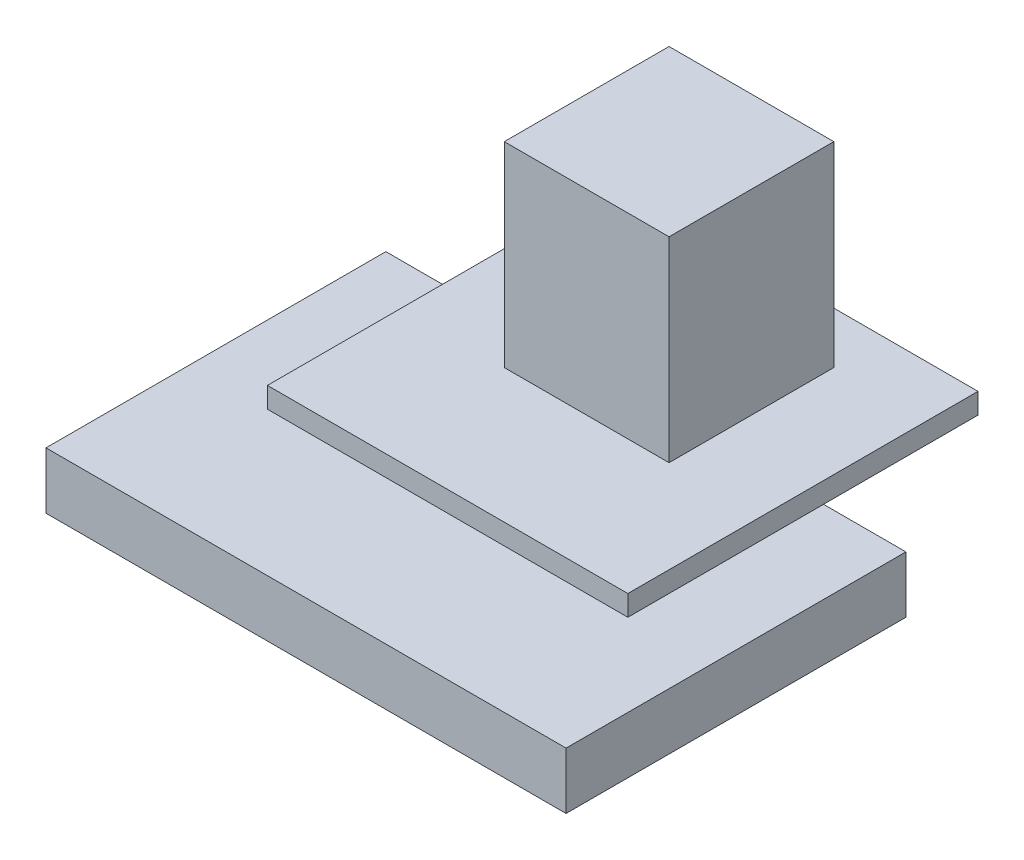
ISO-10303-21;
HEADER;
FILE_DESCRIPTION(('STEP AP214'),'2;1');
FILE_NAME('part.step','',(''),(''),'','','');
FILE_SCHEMA(('AUTOMOTIVE_DESIGN { 1 0 10303 214 1 1 1 1 }'));
ENDSEC;
DATA;
#1=APPLICATION_CONTEXT('core data for automotive mechanical design processes');
#2=APPLICATION_PROTOCOL_DEFINITION('international standard','automotive_design',2000,#1);
#3=PRODUCT_CONTEXT('',#1,'mechanical');
#4=PRODUCT('Part','Part','',(#3));
#5=PRODUCT_RELATED_PRODUCT_CATEGORY('part','',(#4));
#6=PRODUCT_DEFINITION_FORMATION('','',#4);
#7=PRODUCT_DEFINITION_CONTEXT('part definition',#1,'design');
#8=PRODUCT_DEFINITION('design','',#6,#7);
#9=PRODUCT_DEFINITION_SHAPE('','',#8);
#10=(LENGTH_UNIT() NAMED_UNIT(*) SI_UNIT(.MILLI.,.METRE.));
#11=(NAMED_UNIT(*) PLANE_ANGLE_UNIT() SI_UNIT($,.RADIAN.));
#12=(NAMED_UNIT(*) SI_UNIT($,.STERADIAN.) SOLID_ANGLE_UNIT());
#13=UNCERTAINTY_MEASURE_WITH_UNIT(LENGTH_MEASURE(1.E-05),#10,'distance_accuracy_value','');
#14=(GEOMETRIC_REPRESENTATION_CONTEXT(3) GLOBAL_UNCERTAINTY_ASSIGNED_CONTEXT((#13)) GLOBAL_UNIT_ASSIGNED_CONTEXT((#10,
#11,#12)) REPRESENTATION_CONTEXT('',''));
#15=CARTESIAN_POINT('',(0.,0.,0.));
#16=DIRECTION('',(0.,0.,1.));
#17=DIRECTION('',(1.,0.,0.));
#18=AXIS2_PLACEMENT_3D('',#15,#16,#17);
#19=CARTESIAN_POINT('',(0.,7.5,0.));
#20=DIRECTION('',(0.,-1.,0.));
#21=DIRECTION('',(0.,0.,-1.));
#22=AXIS2_PLACEMENT_3D('',#19,#20,#21);
#23=PLANE('',#22);
#24=DIRECTION('',(0.,0.,1.));
#25=VECTOR('',#24,1.);
#26=CARTESIAN_POINT('',(7.49999999999999,7.5,-14.));
#27=LINE('',#26,#25);
#28=CARTESIAN_POINT('',(7.49999999999999,7.5,-48.));
#29=VERTEX_POINT('',#28);
#30=CARTESIAN_POINT('',(7.49999999999999,7.5,-14.));
#31=VERTEX_POINT('',#30);
#32=EDGE_CURVE('E169',#29,#31,#27,.T.);
#33=ORIENTED_EDGE('',*,*,#32,.T.);
#34=DIRECTION('',(1.,0.,0.));
#35=VECTOR('',#34,1.);
#36=CARTESIAN_POINT('',(7.49999999999999,7.5,-14.));
#37=LINE('',#36,#35);
#38=CARTESIAN_POINT('',(42.5,7.5,-14.));
#39=VERTEX_POINT('',#38);
#40=EDGE_CURVE('E173',#31,#39,#37,.T.);
#41=ORIENTED_EDGE('',*,*,#40,.T.);
#42=DIRECTION('',(0.,0.,-1.));
#43=VECTOR('',#42,1.);
#44=CARTESIAN_POINT('',(42.5,7.5,-14.));
#45=LINE('',#44,#43);
#46=CARTESIAN_POINT('',(42.5,7.5,-48.));
#47=VERTEX_POINT('',#46);
#48=EDGE_CURVE('E177',#39,#47,#45,.T.);
#49=ORIENTED_EDGE('',*,*,#48,.T.);
#50=DIRECTION('',(-1.,0.,0.));
#51=VECTOR('',#50,1.);
#52=CARTESIAN_POINT('',(7.49999999999999,7.5,-48.));
#53=LINE('',#52,#51);
#54=EDGE_CURVE('E180',#47,#29,#53,.T.);
#55=ORIENTED_EDGE('',*,*,#54,.T.);
#56=EDGE_LOOP('',(#33,#41,#49,#55));
#57=FACE_BOUND('',#56,.T.);
#58=DIRECTION('',(0.,0.,1.));
#59=VECTOR('',#58,1.);
#60=CARTESIAN_POINT('',(17.5,7.5,-27.));
#61=LINE('',#60,#59);
#62=CARTESIAN_POINT('',(17.5,7.5,-43.));
#63=VERTEX_POINT('',#62);
#64=CARTESIAN_POINT('',(17.5,7.5,-27.));
#65=VERTEX_POINT('',#64);
#66=EDGE_CURVE('E57',#63,#65,#61,.T.);
#67=ORIENTED_EDGE('',*,*,#66,.F.);
#68=DIRECTION('',(-1.,0.,0.));
#69=VECTOR('',#68,1.);
#70=CARTESIAN_POINT('',(17.5,7.5,-43.));
#71=LINE('',#70,#69);
#72=CARTESIAN_POINT('',(33.5,7.5,-43.));
#73=VERTEX_POINT('',#72);
#74=EDGE_CURVE('E61',#73,#63,#71,.T.);
#75=ORIENTED_EDGE('',*,*,#74,.F.);
#76=DIRECTION('',(0.,0.,-1.));
#77=VECTOR('',#76,1.);
#78=CARTESIAN_POINT('',(33.5,7.5,-27.));
#79=LINE('',#78,#77);
#80=CARTESIAN_POINT('',(33.5,7.5,-27.));
#81=VERTEX_POINT('',#80);
#82=EDGE_CURVE('E424',#81,#73,#79,.T.);
#83=ORIENTED_EDGE('',*,*,#82,.F.);
#84=DIRECTION('',(1.,0.,0.));
#85=VECTOR('',#84,1.);
#86=CARTESIAN_POINT('',(17.5,7.5,-27.));
#87=LINE('',#86,#85);
#88=EDGE_CURVE('E434',#65,#81,#87,.T.);
#89=ORIENTED_EDGE('',*,*,#88,.F.);
#90=EDGE_LOOP('',(#67,#75,#83,#89));
#91=FACE_BOUND('',#90,.T.);
#92=ADVANCED_FACE('F39',(#57,#91),#23,.F.);
#93=CARTESIAN_POINT('',(0.,5.5,0.));
#94=DIRECTION('',(0.,-1.,0.));
#95=DIRECTION('',(0.,0.,-1.));
#96=AXIS2_PLACEMENT_3D('',#93,#94,#95);
#97=PLANE('',#96);
#98=DIRECTION('',(0.,0.,1.));
#99=VECTOR('',#98,1.);
#100=CARTESIAN_POINT('',(7.49999999999999,5.5,-14.));
#101=LINE('',#100,#99);
#102=CARTESIAN_POINT('',(7.49999999999999,5.5,-33.));
#103=VERTEX_POINT('',#102);
#104=CARTESIAN_POINT('',(7.49999999999999,5.5,-14.));
#105=VERTEX_POINT('',#104);
#106=EDGE_CURVE('E11',#103,#105,#101,.T.);
#107=ORIENTED_EDGE('',*,*,#106,.F.);
#108=DIRECTION('',(-1.,0.,0.));
#109=VECTOR('',#108,1.);
#110=CARTESIAN_POINT('',(0.,5.5,-33.));
#111=LINE('',#110,#109);
#112=CARTESIAN_POINT('',(0.,5.5,-33.));
#113=VERTEX_POINT('',#112);
#114=EDGE_CURVE('E221',#103,#113,#111,.T.);
#115=ORIENTED_EDGE('',*,*,#114,.T.);
#116=DIRECTION('',(0.,0.,1.));
#117=VECTOR('',#116,1.);
#118=CARTESIAN_POINT('',(0.,5.5,0.));
#119=LINE('',#118,#117);
#120=CARTESIAN_POINT('',(0.,5.5,0.));
#121=VERTEX_POINT('',#120);
#122=EDGE_CURVE('E210',#113,#121,#119,.T.);
#123=ORIENTED_EDGE('',*,*,#122,.T.);
#124=DIRECTION('',(1.,0.,0.));
#125=VECTOR('',#124,1.);
#126=CARTESIAN_POINT('',(0.,5.5,0.));
#127=LINE('',#126,#125);
#128=CARTESIAN_POINT('',(50.5,5.5,0.));
#129=VERTEX_POINT('',#128);
#130=EDGE_CURVE('E214',#121,#129,#127,.T.);
#131=ORIENTED_EDGE('',*,*,#130,.T.);
#132=DIRECTION('',(0.,0.,-1.));
#133=VECTOR('',#132,1.);
#134=CARTESIAN_POINT('',(50.5,5.5,0.));
#135=LINE('',#134,#133);
#136=CARTESIAN_POINT('',(50.5,5.5,-33.));
#137=VERTEX_POINT('',#136);
#138=EDGE_CURVE('E218',#129,#137,#135,.T.);
#139=ORIENTED_EDGE('',*,*,#138,.T.);
#140=CARTESIAN_POINT('',(42.5,5.5,-33.));
#141=VERTEX_POINT('',#140);
#142=EDGE_CURVE('E222',#137,#141,#111,.T.);
#143=ORIENTED_EDGE('',*,*,#142,.T.);
#144=DIRECTION('',(0.,0.,-1.));
#145=VECTOR('',#144,1.);
#146=CARTESIAN_POINT('',(42.5,5.5,-14.));
#147=LINE('',#146,#145);
#148=CARTESIAN_POINT('',(42.5,5.5,-14.));
#149=VERTEX_POINT('',#148);
#150=EDGE_CURVE('E188',#149,#141,#147,.T.);
#151=ORIENTED_EDGE('',*,*,#150,.F.);
#152=DIRECTION('',(1.,0.,0.));
#153=VECTOR('',#152,1.);
#154=CARTESIAN_POINT('',(7.49999999999999,5.5,-14.));
#155=LINE('',#154,#153);
#156=EDGE_CURVE('E164',#105,#149,#155,.T.);
#157=ORIENTED_EDGE('',*,*,#156,.F.);
#158=EDGE_LOOP('',(#107,#115,#123,#131,#139,#143,#151,#157));
#159=FACE_BOUND('',#158,.T.);
#160=ADVANCED_FACE('F273',(#159),#97,.F.);
#161=CARTESIAN_POINT('',(0.,5.5,0.));
#162=DIRECTION('',(1.,0.,0.));
#163=DIRECTION('',(0.,0.,-1.));
#164=AXIS2_PLACEMENT_3D('',#161,#162,#163);
#165=PLANE('',#164);
#166=DIRECTION('',(0.,0.,1.));
#167=VECTOR('',#166,1.);
#168=CARTESIAN_POINT('',(0.,0.,0.));
#169=LINE('',#168,#167);
#170=CARTESIAN_POINT('',(0.,0.,-33.));
#171=VERTEX_POINT('',#170);
#172=CARTESIAN_POINT('',(0.,0.,0.));
#173=VERTEX_POINT('',#172);
#174=EDGE_CURVE('E209',#171,#173,#169,.T.);
#175=ORIENTED_EDGE('',*,*,#174,.T.);
#176=DIRECTION('',(0.,-1.,0.));
#177=VECTOR('',#176,1.);
#178=CARTESIAN_POINT('',(0.,5.5,0.));
#179=LINE('',#178,#177);
#180=EDGE_CURVE('E43',#121,#173,#179,.T.);
#181=ORIENTED_EDGE('',*,*,#180,.F.);
#182=ORIENTED_EDGE('',*,*,#122,.F.);
#183=DIRECTION('',(0.,-1.,0.));
#184=VECTOR('',#183,1.);
#185=CARTESIAN_POINT('',(0.,5.5,-33.));
#186=LINE('',#185,#184);
#187=EDGE_CURVE('E226',#113,#171,#186,.T.);
#188=ORIENTED_EDGE('',*,*,#187,.T.);
#189=EDGE_LOOP('',(#175,#181,#182,#188));
#190=FACE_BOUND('',#189,.T.);
#191=ADVANCED_FACE('F41',(#190),#165,.F.);
#192=CARTESIAN_POINT('',(0.,5.5,0.));
#193=DIRECTION('',(0.,0.,-1.));
#194=DIRECTION('',(-1.,0.,0.));
#195=AXIS2_PLACEMENT_3D('',#192,#193,#194);
#196=PLANE('',#195);
#197=DIRECTION('',(1.,0.,0.));
#198=VECTOR('',#197,1.);
#199=CARTESIAN_POINT('',(0.,0.,0.));
#200=LINE('',#199,#198);
#201=CARTESIAN_POINT('',(50.5,0.,0.));
#202=VERTEX_POINT('',#201);
#203=EDGE_CURVE('E231',#173,#202,#200,.T.);
#204=ORIENTED_EDGE('',*,*,#203,.T.);
#205=DIRECTION('',(0.,-1.,0.));
#206=VECTOR('',#205,1.);
#207=CARTESIAN_POINT('',(50.5,5.5,0.));
#208=LINE('',#207,#206);
#209=EDGE_CURVE('E245',#129,#202,#208,.T.);
#210=ORIENTED_EDGE('',*,*,#209,.F.);
#211=ORIENTED_EDGE('',*,*,#130,.F.);
#212=ORIENTED_EDGE('',*,*,#180,.T.);
#213=EDGE_LOOP('',(#204,#210,#211,#212));
#214=FACE_BOUND('',#213,.T.);
#215=ADVANCED_FACE('F256',(#214),#196,.F.);
#216=CARTESIAN_POINT('',(50.5,5.5,0.));
#217=DIRECTION('',(-1.,0.,0.));
#218=DIRECTION('',(0.,0.,1.));
#219=AXIS2_PLACEMENT_3D('',#216,#217,#218);
#220=PLANE('',#219);
#221=DIRECTION('',(0.,0.,-1.));
#222=VECTOR('',#221,1.);
#223=CARTESIAN_POINT('',(50.5,0.,0.));
#224=LINE('',#223,#222);
#225=CARTESIAN_POINT('',(50.5,0.,-33.));
#226=VERTEX_POINT('',#225);
#227=EDGE_CURVE('E234',#202,#226,#224,.T.);
#228=ORIENTED_EDGE('',*,*,#227,.T.);
#229=DIRECTION('',(0.,-1.,0.));
#230=VECTOR('',#229,1.);
#231=CARTESIAN_POINT('',(50.5,5.5,-33.));
#232=LINE('',#231,#230);
#233=EDGE_CURVE('E242',#137,#226,#232,.T.);
#234=ORIENTED_EDGE('',*,*,#233,.F.);
#235=ORIENTED_EDGE('',*,*,#138,.F.);
#236=ORIENTED_EDGE('',*,*,#209,.T.);
#237=EDGE_LOOP('',(#228,#234,#235,#236));
#238=FACE_BOUND('',#237,.T.);
#239=ADVANCED_FACE('F265',(#238),#220,.F.);
#240=CARTESIAN_POINT('',(0.,5.5,-33.));
#241=DIRECTION('',(0.,0.,1.));
#242=DIRECTION('',(1.,0.,0.));
#243=AXIS2_PLACEMENT_3D('',#240,#241,#242);
#244=PLANE('',#243);
#245=DIRECTION('',(-1.,0.,0.));
#246=VECTOR('',#245,1.);
#247=CARTESIAN_POINT('',(0.,0.,-33.));
#248=LINE('',#247,#246);
#249=EDGE_CURVE('E215',#226,#171,#248,.T.);
#250=ORIENTED_EDGE('',*,*,#249,.T.);
#251=ORIENTED_EDGE('',*,*,#187,.F.);
#252=ORIENTED_EDGE('',*,*,#114,.F.);
#253=EDGE_CURVE('E227',#141,#103,#111,.T.);
#254=ORIENTED_EDGE('',*,*,#253,.F.);
#255=ORIENTED_EDGE('',*,*,#142,.F.);
#256=ORIENTED_EDGE('',*,*,#233,.T.);
#257=EDGE_LOOP('',(#250,#251,#252,#254,#255,#256));
#258=FACE_BOUND('',#257,.T.);
#259=ADVANCED_FACE('F268',(#258),#244,.F.);
#260=CARTESIAN_POINT('',(0.,0.,0.));
#261=DIRECTION('',(0.,-1.,0.));
#262=DIRECTION('',(0.,0.,-1.));
#263=AXIS2_PLACEMENT_3D('',#260,#261,#262);
#264=PLANE('',#263);
#265=ORIENTED_EDGE('',*,*,#174,.F.);
#266=ORIENTED_EDGE('',*,*,#249,.F.);
#267=ORIENTED_EDGE('',*,*,#227,.F.);
#268=ORIENTED_EDGE('',*,*,#203,.F.);
#269=EDGE_LOOP('',(#265,#266,#267,#268));
#270=FACE_BOUND('',#269,.T.);
#271=ADVANCED_FACE('F263',(#270),#264,.T.);
#272=CARTESIAN_POINT('',(7.49999999999999,7.5,-14.));
#273=DIRECTION('',(1.,0.,0.));
#274=DIRECTION('',(0.,0.,-1.));
#275=AXIS2_PLACEMENT_3D('',#272,#273,#274);
#276=PLANE('',#275);
#277=CARTESIAN_POINT('',(7.49999999999999,5.5,-48.));
#278=VERTEX_POINT('',#277);
#279=EDGE_CURVE('E50',#278,#103,#101,.T.);
#280=ORIENTED_EDGE('',*,*,#279,.T.);
#281=ORIENTED_EDGE('',*,*,#106,.T.);
#282=DIRECTION('',(0.,-1.,0.));
#283=VECTOR('',#282,1.);
#284=CARTESIAN_POINT('',(7.49999999999999,7.5,-14.));
#285=LINE('',#284,#283);
#286=EDGE_CURVE('E205',#31,#105,#285,.T.);
#287=ORIENTED_EDGE('',*,*,#286,.F.);
#288=ORIENTED_EDGE('',*,*,#32,.F.);
#289=DIRECTION('',(0.,-1.,0.));
#290=VECTOR('',#289,1.);
#291=CARTESIAN_POINT('',(7.49999999999999,7.5,-48.));
#292=LINE('',#291,#290);
#293=EDGE_CURVE('E182',#29,#278,#292,.T.);
#294=ORIENTED_EDGE('',*,*,#293,.T.);
#295=EDGE_LOOP('',(#280,#281,#287,#288,#294));
#296=FACE_BOUND('',#295,.T.);
#297=ADVANCED_FACE('F288',(#296),#276,.F.);
#298=CARTESIAN_POINT('',(7.49999999999999,7.5,-14.));
#299=DIRECTION('',(0.,0.,-1.));
#300=DIRECTION('',(-1.,0.,0.));
#301=AXIS2_PLACEMENT_3D('',#298,#299,#300);
#302=PLANE('',#301);
#303=ORIENTED_EDGE('',*,*,#156,.T.);
#304=DIRECTION('',(0.,-1.,0.));
#305=VECTOR('',#304,1.);
#306=CARTESIAN_POINT('',(42.5,7.5,-14.));
#307=LINE('',#306,#305);
#308=EDGE_CURVE('E201',#39,#149,#307,.T.);
#309=ORIENTED_EDGE('',*,*,#308,.F.);
#310=ORIENTED_EDGE('',*,*,#40,.F.);
#311=ORIENTED_EDGE('',*,*,#286,.T.);
#312=EDGE_LOOP('',(#303,#309,#310,#311));
#313=FACE_BOUND('',#312,.T.);
#314=ADVANCED_FACE('F285',(#313),#302,.F.);
#315=CARTESIAN_POINT('',(42.5,7.5,-14.));
#316=DIRECTION('',(-1.,0.,0.));
#317=DIRECTION('',(0.,0.,1.));
#318=AXIS2_PLACEMENT_3D('',#315,#316,#317);
#319=PLANE('',#318);
#320=ORIENTED_EDGE('',*,*,#150,.T.);
#321=CARTESIAN_POINT('',(42.5,5.5,-48.));
#322=VERTEX_POINT('',#321);
#323=EDGE_CURVE('E187',#141,#322,#147,.T.);
#324=ORIENTED_EDGE('',*,*,#323,.T.);
#325=DIRECTION('',(0.,-1.,0.));
#326=VECTOR('',#325,1.);
#327=CARTESIAN_POINT('',(42.5,7.5,-48.));
#328=LINE('',#327,#326);
#329=EDGE_CURVE('E197',#47,#322,#328,.T.);
#330=ORIENTED_EDGE('',*,*,#329,.F.);
#331=ORIENTED_EDGE('',*,*,#48,.F.);
#332=ORIENTED_EDGE('',*,*,#308,.T.);
#333=EDGE_LOOP('',(#320,#324,#330,#331,#332));
#334=FACE_BOUND('',#333,.T.);
#335=ADVANCED_FACE('F281',(#334),#319,.F.);
#336=CARTESIAN_POINT('',(7.49999999999999,7.5,-48.));
#337=DIRECTION('',(0.,0.,1.));
#338=DIRECTION('',(1.,0.,0.));
#339=AXIS2_PLACEMENT_3D('',#336,#337,#338);
#340=PLANE('',#339);
#341=DIRECTION('',(-1.,0.,0.));
#342=VECTOR('',#341,1.);
#343=CARTESIAN_POINT('',(7.49999999999999,5.5,-48.));
#344=LINE('',#343,#342);
#345=EDGE_CURVE('E174',#322,#278,#344,.T.);
#346=ORIENTED_EDGE('',*,*,#345,.T.);
#347=ORIENTED_EDGE('',*,*,#293,.F.);
#348=ORIENTED_EDGE('',*,*,#54,.F.);
#349=ORIENTED_EDGE('',*,*,#329,.T.);
#350=EDGE_LOOP('',(#346,#347,#348,#349));
#351=FACE_BOUND('',#350,.T.);
#352=ADVANCED_FACE('F293',(#351),#340,.F.);
#353=CARTESIAN_POINT('',(0.,5.5,0.));
#354=DIRECTION('',(0.,-1.,0.));
#355=DIRECTION('',(0.,0.,-1.));
#356=AXIS2_PLACEMENT_3D('',#353,#354,#355);
#357=PLANE('',#356);
#358=ORIENTED_EDGE('',*,*,#323,.F.);
#359=ORIENTED_EDGE('',*,*,#253,.T.);
#360=ORIENTED_EDGE('',*,*,#279,.F.);
#361=ORIENTED_EDGE('',*,*,#345,.F.);
#362=EDGE_LOOP('',(#358,#359,#360,#361));
#363=FACE_BOUND('',#362,.T.);
#364=ADVANCED_FACE('F276',(#363),#357,.T.);
#365=CARTESIAN_POINT('',(17.5,26.5,-27.));
#366=DIRECTION('',(1.,0.,0.));
#367=DIRECTION('',(0.,0.,-1.));
#368=AXIS2_PLACEMENT_3D('',#365,#366,#367);
#369=PLANE('',#368);
#370=ORIENTED_EDGE('',*,*,#66,.T.);
#371=DIRECTION('',(0.,-1.,0.));
#372=VECTOR('',#371,1.);
#373=CARTESIAN_POINT('',(17.5,26.5,-27.));
#374=LINE('',#373,#372);
#375=CARTESIAN_POINT('',(17.5,26.5,-27.));
#376=VERTEX_POINT('',#375);
#377=EDGE_CURVE('E140',#376,#65,#374,.T.);
#378=ORIENTED_EDGE('',*,*,#377,.F.);
#379=DIRECTION('',(0.,0.,1.));
#380=VECTOR('',#379,1.);
#381=CARTESIAN_POINT('',(17.5,26.5,-27.));
#382=LINE('',#381,#380);
#383=CARTESIAN_POINT('',(17.5,26.5,-43.));
#384=VERTEX_POINT('',#383);
#385=EDGE_CURVE('E147',#384,#376,#382,.T.);
#386=ORIENTED_EDGE('',*,*,#385,.F.);
#387=DIRECTION('',(0.,-1.,0.));
#388=VECTOR('',#387,1.);
#389=CARTESIAN_POINT('',(17.5,26.5,-43.));
#390=LINE('',#389,#388);
#391=EDGE_CURVE('E421',#384,#63,#390,.T.);
#392=ORIENTED_EDGE('',*,*,#391,.T.);
#393=EDGE_LOOP('',(#370,#378,#386,#392));
#394=FACE_BOUND('',#393,.T.);
#395=ADVANCED_FACE('F158',(#394),#369,.F.);
#396=CARTESIAN_POINT('',(17.5,26.5,-27.));
#397=DIRECTION('',(0.,0.,-1.));
#398=DIRECTION('',(-1.,0.,0.));
#399=AXIS2_PLACEMENT_3D('',#396,#397,#398);
#400=PLANE('',#399);
#401=ORIENTED_EDGE('',*,*,#88,.T.);
#402=DIRECTION('',(0.,-1.,0.));
#403=VECTOR('',#402,1.);
#404=CARTESIAN_POINT('',(33.5,26.5,-27.));
#405=LINE('',#404,#403);
#406=CARTESIAN_POINT('',(33.5,26.5,-27.));
#407=VERTEX_POINT('',#406);
#408=EDGE_CURVE('E142',#407,#81,#405,.T.);
#409=ORIENTED_EDGE('',*,*,#408,.F.);
#410=DIRECTION('',(1.,0.,0.));
#411=VECTOR('',#410,1.);
#412=CARTESIAN_POINT('',(17.5,26.5,-27.));
#413=LINE('',#412,#411);
#414=EDGE_CURVE('E135',#376,#407,#413,.T.);
#415=ORIENTED_EDGE('',*,*,#414,.F.);
#416=ORIENTED_EDGE('',*,*,#377,.T.);
#417=EDGE_LOOP('',(#401,#409,#415,#416));
#418=FACE_BOUND('',#417,.T.);
#419=ADVANCED_FACE('F138',(#418),#400,.F.);
#420=CARTESIAN_POINT('',(33.5,26.5,-27.));
#421=DIRECTION('',(-1.,0.,0.));
#422=DIRECTION('',(0.,0.,1.));
#423=AXIS2_PLACEMENT_3D('',#420,#421,#422);
#424=PLANE('',#423);
#425=ORIENTED_EDGE('',*,*,#82,.T.);
#426=DIRECTION('',(0.,-1.,0.));
#427=VECTOR('',#426,1.);
#428=CARTESIAN_POINT('',(33.5,26.5,-43.));
#429=LINE('',#428,#427);
#430=CARTESIAN_POINT('',(33.5,26.5,-43.));
#431=VERTEX_POINT('',#430);
#432=EDGE_CURVE('E165',#431,#73,#429,.T.);
#433=ORIENTED_EDGE('',*,*,#432,.F.);
#434=DIRECTION('',(0.,0.,-1.));
#435=VECTOR('',#434,1.);
#436=CARTESIAN_POINT('',(33.5,26.5,-27.));
#437=LINE('',#436,#435);
#438=EDGE_CURVE('E146',#407,#431,#437,.T.);
#439=ORIENTED_EDGE('',*,*,#438,.F.);
#440=ORIENTED_EDGE('',*,*,#408,.T.);
#441=EDGE_LOOP('',(#425,#433,#439,#440));
#442=FACE_BOUND('',#441,.T.);
#443=ADVANCED_FACE('F390',(#442),#424,.F.);
#444=CARTESIAN_POINT('',(17.5,26.5,-43.));
#445=DIRECTION('',(0.,0.,1.));
#446=DIRECTION('',(1.,0.,0.));
#447=AXIS2_PLACEMENT_3D('',#444,#445,#446);
#448=PLANE('',#447);
#449=ORIENTED_EDGE('',*,*,#74,.T.);
#450=ORIENTED_EDGE('',*,*,#391,.F.);
#451=DIRECTION('',(-1.,0.,0.));
#452=VECTOR('',#451,1.);
#453=CARTESIAN_POINT('',(17.5,26.5,-43.));
#454=LINE('',#453,#452);
#455=EDGE_CURVE('E152',#431,#384,#454,.T.);
#456=ORIENTED_EDGE('',*,*,#455,.F.);
#457=ORIENTED_EDGE('',*,*,#432,.T.);
#458=EDGE_LOOP('',(#449,#450,#456,#457));
#459=FACE_BOUND('',#458,.T.);
#460=ADVANCED_FACE('F398',(#459),#448,.F.);
#461=CARTESIAN_POINT('',(0.,26.5,0.));
#462=DIRECTION('',(0.,-1.,0.));
#463=DIRECTION('',(0.,0.,-1.));
#464=AXIS2_PLACEMENT_3D('',#461,#462,#463);
#465=PLANE('',#464);
#466=ORIENTED_EDGE('',*,*,#385,.T.);
#467=ORIENTED_EDGE('',*,*,#414,.T.);
#468=ORIENTED_EDGE('',*,*,#438,.T.);
#469=ORIENTED_EDGE('',*,*,#455,.T.);
#470=EDGE_LOOP('',(#466,#467,#468,#469));
#471=FACE_BOUND('',#470,.T.);
#472=ADVANCED_FACE('F150',(#471),#465,.F.);
#473=CLOSED_SHELL('',(#92,#160,#191,#215,#239,#259,#271,#297,#314,#335,#352,#364,#395,#419,#443,
#460,#472));
#474=MANIFOLD_SOLID_BREP('B2',#473);
#475=ADVANCED_BREP_SHAPE_REPRESENTATION('',(#18,#474),#14);
#476=SHAPE_DEFINITION_REPRESENTATION(#9,#475);
ENDSEC;
END-ISO-10303-21;
